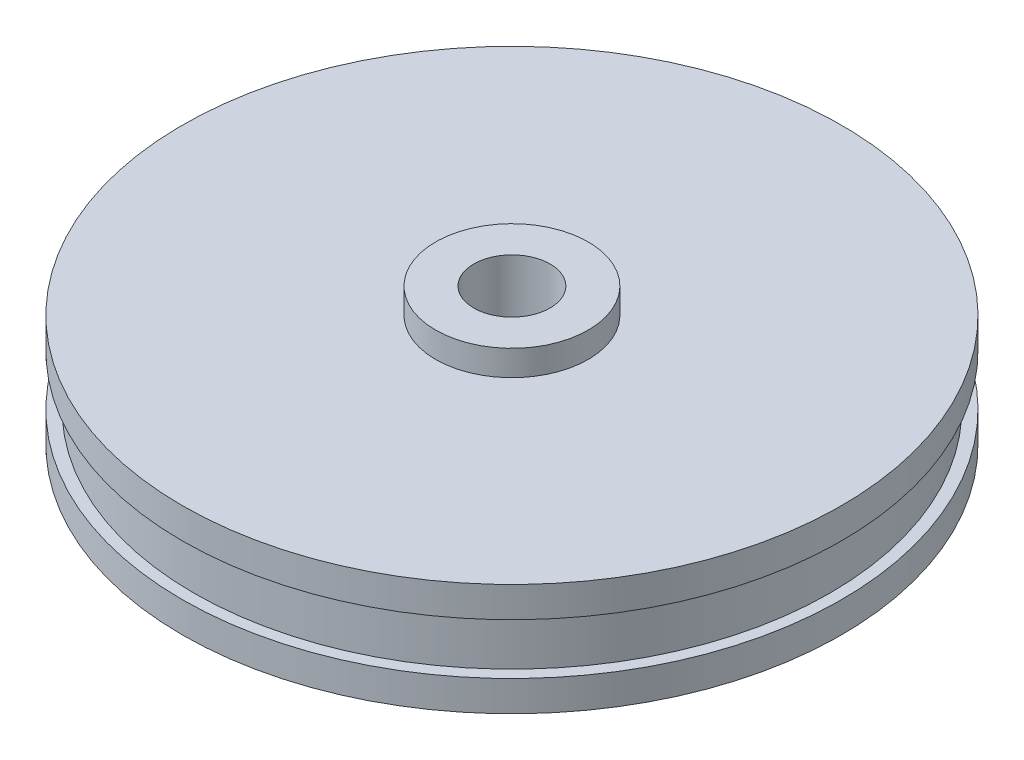
ISO-10303-21;
HEADER;
FILE_DESCRIPTION(('STEP AP214'),'2;1');
FILE_NAME('part.step','',(''),(''),'','','');
FILE_SCHEMA(('AUTOMOTIVE_DESIGN { 1 0 10303 214 1 1 1 1 }'));
ENDSEC;
DATA;
#1=APPLICATION_CONTEXT('core data for automotive mechanical design processes');
#2=APPLICATION_PROTOCOL_DEFINITION('international standard','automotive_design',2000,#1);
#3=PRODUCT_CONTEXT('',#1,'mechanical');
#4=PRODUCT('Part','Part','',(#3));
#5=PRODUCT_RELATED_PRODUCT_CATEGORY('part','',(#4));
#6=PRODUCT_DEFINITION_FORMATION('','',#4);
#7=PRODUCT_DEFINITION_CONTEXT('part definition',#1,'design');
#8=PRODUCT_DEFINITION('design','',#6,#7);
#9=PRODUCT_DEFINITION_SHAPE('','',#8);
#10=(LENGTH_UNIT() NAMED_UNIT(*) SI_UNIT(.MILLI.,.METRE.));
#11=(NAMED_UNIT(*) PLANE_ANGLE_UNIT() SI_UNIT($,.RADIAN.));
#12=(NAMED_UNIT(*) SI_UNIT($,.STERADIAN.) SOLID_ANGLE_UNIT());
#13=UNCERTAINTY_MEASURE_WITH_UNIT(LENGTH_MEASURE(1.E-05),#10,'distance_accuracy_value','');
#14=(GEOMETRIC_REPRESENTATION_CONTEXT(3) GLOBAL_UNCERTAINTY_ASSIGNED_CONTEXT((#13)) GLOBAL_UNIT_ASSIGNED_CONTEXT((#10,
#11,#12)) REPRESENTATION_CONTEXT('',''));
#15=CARTESIAN_POINT('',(0.,0.,0.));
#16=DIRECTION('',(0.,0.,1.));
#17=DIRECTION('',(1.,0.,0.));
#18=AXIS2_PLACEMENT_3D('',#15,#16,#17);
#19=CARTESIAN_POINT('',(0.,17.85,0.));
#20=DIRECTION('',(0.,1.,0.));
#21=DIRECTION('',(0.,0.,1.));
#22=AXIS2_PLACEMENT_3D('',#19,#20,#21);
#23=CYLINDRICAL_SURFACE('',#22,12.95);
#24=CARTESIAN_POINT('',(0.,-1.,0.));
#25=DIRECTION('',(0.,1.,0.));
#26=DIRECTION('',(0.,0.,1.));
#27=AXIS2_PLACEMENT_3D('',#24,#25,#26);
#28=CIRCLE('',#27,12.95);
#29=CARTESIAN_POINT('',(0.,-1.,12.95));
#30=VERTEX_POINT('',#29);
#31=EDGE_CURVE('E65',#30,#30,#28,.T.);
#32=ORIENTED_EDGE('',*,*,#31,.F.);
#33=EDGE_LOOP('',(#32));
#34=FACE_BOUND('',#33,.T.);
#35=CARTESIAN_POINT('',(0.,-2.2,0.));
#36=DIRECTION('',(0.,1.,0.));
#37=DIRECTION('',(0.,0.,1.));
#38=AXIS2_PLACEMENT_3D('',#35,#36,#37);
#39=CIRCLE('',#38,12.95);
#40=CARTESIAN_POINT('',(0.,-2.2,12.95));
#41=VERTEX_POINT('',#40);
#42=EDGE_CURVE('E10',#41,#41,#39,.T.);
#43=ORIENTED_EDGE('',*,*,#42,.T.);
#44=EDGE_LOOP('',(#43));
#45=FACE_BOUND('',#44,.T.);
#46=ADVANCED_FACE('F31',(#34,#45),#23,.T.);
#47=CARTESIAN_POINT('',(12.95,-2.2,0.));
#48=DIRECTION('',(0.,1.,0.));
#49=DIRECTION('',(0.,0.,1.));
#50=AXIS2_PLACEMENT_3D('',#47,#48,#49);
#51=PLANE('',#50);
#52=ORIENTED_EDGE('',*,*,#42,.F.);
#53=EDGE_LOOP('',(#52));
#54=FACE_BOUND('',#53,.T.);
#55=CARTESIAN_POINT('',(0.,-2.2,0.));
#56=DIRECTION('',(0.,1.,0.));
#57=DIRECTION('',(0.,0.,1.));
#58=AXIS2_PLACEMENT_3D('',#55,#56,#57);
#59=CIRCLE('',#58,1.5);
#60=CARTESIAN_POINT('',(0.,-2.2,1.5));
#61=VERTEX_POINT('',#60);
#62=EDGE_CURVE('E37',#61,#61,#59,.T.);
#63=ORIENTED_EDGE('',*,*,#62,.T.);
#64=EDGE_LOOP('',(#63));
#65=FACE_BOUND('',#64,.T.);
#66=ADVANCED_FACE('F72',(#54,#65),#51,.F.);
#67=CARTESIAN_POINT('',(0.,17.85,0.));
#68=DIRECTION('',(0.,1.,0.));
#69=DIRECTION('',(0.,0.,1.));
#70=AXIS2_PLACEMENT_3D('',#67,#68,#69);
#71=CYLINDRICAL_SURFACE('',#70,1.5);
#72=ORIENTED_EDGE('',*,*,#62,.F.);
#73=EDGE_LOOP('',(#72));
#74=FACE_BOUND('',#73,.T.);
#75=CARTESIAN_POINT('',(0.,3.2,0.));
#76=DIRECTION('',(0.,1.,0.));
#77=DIRECTION('',(0.,0.,1.));
#78=AXIS2_PLACEMENT_3D('',#75,#76,#77);
#79=CIRCLE('',#78,1.5);
#80=CARTESIAN_POINT('',(0.,3.2,1.5));
#81=VERTEX_POINT('',#80);
#82=EDGE_CURVE('E41',#81,#81,#79,.T.);
#83=ORIENTED_EDGE('',*,*,#82,.T.);
#84=EDGE_LOOP('',(#83));
#85=FACE_BOUND('',#84,.T.);
#86=ADVANCED_FACE('F76',(#74,#85),#71,.F.);
#87=CARTESIAN_POINT('',(1.5,3.2,0.));
#88=DIRECTION('',(0.,-1.,0.));
#89=DIRECTION('',(0.,0.,-1.));
#90=AXIS2_PLACEMENT_3D('',#87,#88,#89);
#91=PLANE('',#90);
#92=ORIENTED_EDGE('',*,*,#82,.F.);
#93=EDGE_LOOP('',(#92));
#94=FACE_BOUND('',#93,.T.);
#95=CARTESIAN_POINT('',(0.,3.2,0.));
#96=DIRECTION('',(0.,1.,0.));
#97=DIRECTION('',(0.,0.,1.));
#98=AXIS2_PLACEMENT_3D('',#95,#96,#97);
#99=CIRCLE('',#98,3.);
#100=CARTESIAN_POINT('',(0.,3.2,3.));
#101=VERTEX_POINT('',#100);
#102=EDGE_CURVE('E45',#101,#101,#99,.T.);
#103=ORIENTED_EDGE('',*,*,#102,.T.);
#104=EDGE_LOOP('',(#103));
#105=FACE_BOUND('',#104,.T.);
#106=ADVANCED_FACE('F81',(#94,#105),#91,.F.);
#107=CARTESIAN_POINT('',(0.,17.85,0.));
#108=DIRECTION('',(0.,1.,0.));
#109=DIRECTION('',(0.,0.,1.));
#110=AXIS2_PLACEMENT_3D('',#107,#108,#109);
#111=CYLINDRICAL_SURFACE('',#110,3.);
#112=ORIENTED_EDGE('',*,*,#102,.F.);
#113=EDGE_LOOP('',(#112));
#114=FACE_BOUND('',#113,.T.);
#115=CARTESIAN_POINT('',(0.,2.2,0.));
#116=DIRECTION('',(0.,1.,0.));
#117=DIRECTION('',(0.,0.,1.));
#118=AXIS2_PLACEMENT_3D('',#115,#116,#117);
#119=CIRCLE('',#118,3.);
#120=CARTESIAN_POINT('',(0.,2.2,3.));
#121=VERTEX_POINT('',#120);
#122=EDGE_CURVE('E50',#121,#121,#119,.T.);
#123=ORIENTED_EDGE('',*,*,#122,.T.);
#124=EDGE_LOOP('',(#123));
#125=FACE_BOUND('',#124,.T.);
#126=ADVANCED_FACE('F87',(#114,#125),#111,.T.);
#127=CARTESIAN_POINT('',(3.,2.2,0.));
#128=DIRECTION('',(0.,-1.,0.));
#129=DIRECTION('',(0.,0.,-1.));
#130=AXIS2_PLACEMENT_3D('',#127,#128,#129);
#131=PLANE('',#130);
#132=ORIENTED_EDGE('',*,*,#122,.F.);
#133=EDGE_LOOP('',(#132));
#134=FACE_BOUND('',#133,.T.);
#135=CARTESIAN_POINT('',(0.,2.2,0.));
#136=DIRECTION('',(0.,1.,0.));
#137=DIRECTION('',(0.,0.,1.));
#138=AXIS2_PLACEMENT_3D('',#135,#136,#137);
#139=CIRCLE('',#138,12.95);
#140=CARTESIAN_POINT('',(0.,2.2,12.95));
#141=VERTEX_POINT('',#140);
#142=EDGE_CURVE('E53',#141,#141,#139,.T.);
#143=ORIENTED_EDGE('',*,*,#142,.T.);
#144=EDGE_LOOP('',(#143));
#145=FACE_BOUND('',#144,.T.);
#146=ADVANCED_FACE('F91',(#134,#145),#131,.F.);
#147=CARTESIAN_POINT('',(0.,17.85,0.));
#148=DIRECTION('',(0.,1.,0.));
#149=DIRECTION('',(0.,0.,1.));
#150=AXIS2_PLACEMENT_3D('',#147,#148,#149);
#151=CYLINDRICAL_SURFACE('',#150,12.95);
#152=ORIENTED_EDGE('',*,*,#142,.F.);
#153=EDGE_LOOP('',(#152));
#154=FACE_BOUND('',#153,.T.);
#155=CARTESIAN_POINT('',(0.,1.,0.));
#156=DIRECTION('',(0.,1.,0.));
#157=DIRECTION('',(0.,0.,1.));
#158=AXIS2_PLACEMENT_3D('',#155,#156,#157);
#159=CIRCLE('',#158,12.95);
#160=CARTESIAN_POINT('',(0.,1.,12.95));
#161=VERTEX_POINT('',#160);
#162=EDGE_CURVE('E56',#161,#161,#159,.T.);
#163=ORIENTED_EDGE('',*,*,#162,.T.);
#164=EDGE_LOOP('',(#163));
#165=FACE_BOUND('',#164,.T.);
#166=ADVANCED_FACE('F95',(#154,#165),#151,.T.);
#167=CARTESIAN_POINT('',(12.95,1.,0.));
#168=DIRECTION('',(0.,1.,0.));
#169=DIRECTION('',(0.,0.,1.));
#170=AXIS2_PLACEMENT_3D('',#167,#168,#169);
#171=PLANE('',#170);
#172=ORIENTED_EDGE('',*,*,#162,.F.);
#173=EDGE_LOOP('',(#172));
#174=FACE_BOUND('',#173,.T.);
#175=CARTESIAN_POINT('',(0.,1.,0.));
#176=DIRECTION('',(0.,1.,0.));
#177=DIRECTION('',(0.,0.,1.));
#178=AXIS2_PLACEMENT_3D('',#175,#176,#177);
#179=CIRCLE('',#178,12.5);
#180=CARTESIAN_POINT('',(0.,1.,12.5));
#181=VERTEX_POINT('',#180);
#182=EDGE_CURVE('E59',#181,#181,#179,.T.);
#183=ORIENTED_EDGE('',*,*,#182,.T.);
#184=EDGE_LOOP('',(#183));
#185=FACE_BOUND('',#184,.T.);
#186=ADVANCED_FACE('F99',(#174,#185),#171,.F.);
#187=CARTESIAN_POINT('',(0.,17.85,0.));
#188=DIRECTION('',(0.,1.,0.));
#189=DIRECTION('',(0.,0.,1.));
#190=AXIS2_PLACEMENT_3D('',#187,#188,#189);
#191=CYLINDRICAL_SURFACE('',#190,12.5);
#192=ORIENTED_EDGE('',*,*,#182,.F.);
#193=EDGE_LOOP('',(#192));
#194=FACE_BOUND('',#193,.T.);
#195=CARTESIAN_POINT('',(0.,-1.,0.));
#196=DIRECTION('',(0.,1.,0.));
#197=DIRECTION('',(0.,0.,1.));
#198=AXIS2_PLACEMENT_3D('',#195,#196,#197);
#199=CIRCLE('',#198,12.5);
#200=CARTESIAN_POINT('',(0.,-1.,12.5));
#201=VERTEX_POINT('',#200);
#202=EDGE_CURVE('E62',#201,#201,#199,.T.);
#203=ORIENTED_EDGE('',*,*,#202,.T.);
#204=EDGE_LOOP('',(#203));
#205=FACE_BOUND('',#204,.T.);
#206=ADVANCED_FACE('F103',(#194,#205),#191,.T.);
#207=CARTESIAN_POINT('',(12.5,-1.,0.));
#208=DIRECTION('',(0.,-1.,0.));
#209=DIRECTION('',(0.,0.,-1.));
#210=AXIS2_PLACEMENT_3D('',#207,#208,#209);
#211=PLANE('',#210);
#212=ORIENTED_EDGE('',*,*,#202,.F.);
#213=EDGE_LOOP('',(#212));
#214=FACE_BOUND('',#213,.T.);
#215=ORIENTED_EDGE('',*,*,#31,.T.);
#216=EDGE_LOOP('',(#215));
#217=FACE_BOUND('',#216,.T.);
#218=ADVANCED_FACE('F69',(#214,#217),#211,.F.);
#219=CLOSED_SHELL('',(#46,#66,#86,#106,#126,#146,#166,#186,#206,#218));
#220=MANIFOLD_SOLID_BREP('B2',#219);
#221=ADVANCED_BREP_SHAPE_REPRESENTATION('',(#18,#220),#14);
#222=SHAPE_DEFINITION_REPRESENTATION(#9,#221);
ENDSEC;
END-ISO-10303-21;
